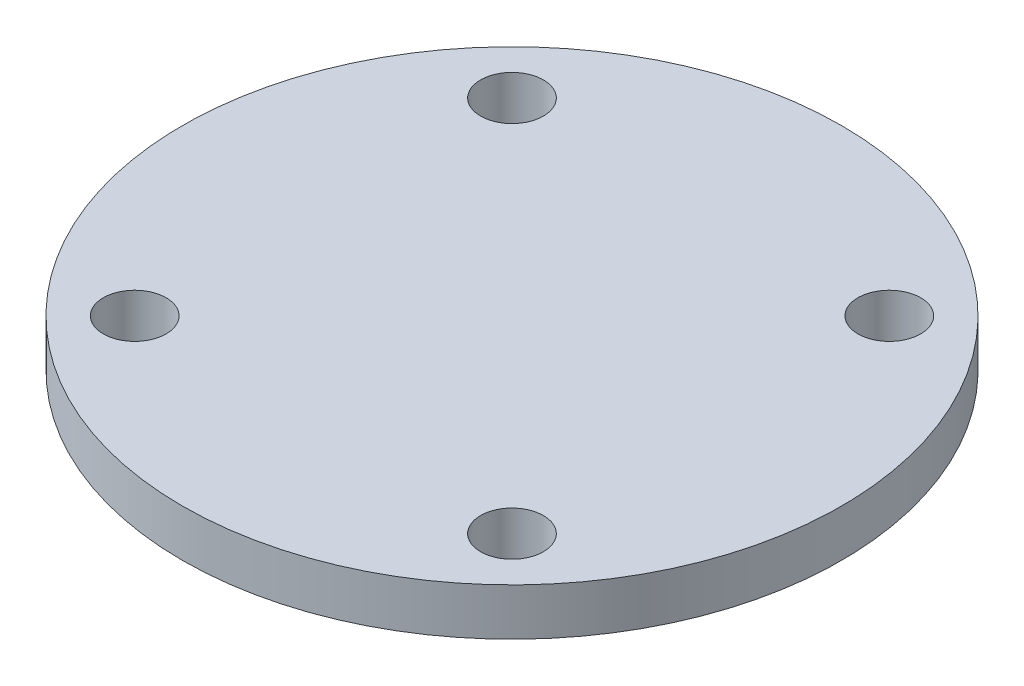
ISO-10303-21;
HEADER;
FILE_DESCRIPTION(('STEP AP214'),'2;1');
FILE_NAME('part.step','',(''),(''),'','','');
FILE_SCHEMA(('AUTOMOTIVE_DESIGN { 1 0 10303 214 1 1 1 1 }'));
ENDSEC;
DATA;
#1=APPLICATION_CONTEXT('core data for automotive mechanical design processes');
#2=APPLICATION_PROTOCOL_DEFINITION('international standard','automotive_design',2000,#1);
#3=PRODUCT_CONTEXT('',#1,'mechanical');
#4=PRODUCT('Part','Part','',(#3));
#5=PRODUCT_RELATED_PRODUCT_CATEGORY('part','',(#4));
#6=PRODUCT_DEFINITION_FORMATION('','',#4);
#7=PRODUCT_DEFINITION_CONTEXT('part definition',#1,'design');
#8=PRODUCT_DEFINITION('design','',#6,#7);
#9=PRODUCT_DEFINITION_SHAPE('','',#8);
#10=(LENGTH_UNIT() NAMED_UNIT(*) SI_UNIT(.MILLI.,.METRE.));
#11=(NAMED_UNIT(*) PLANE_ANGLE_UNIT() SI_UNIT($,.RADIAN.));
#12=(NAMED_UNIT(*) SI_UNIT($,.STERADIAN.) SOLID_ANGLE_UNIT());
#13=UNCERTAINTY_MEASURE_WITH_UNIT(LENGTH_MEASURE(1.E-05),#10,'distance_accuracy_value','');
#14=(GEOMETRIC_REPRESENTATION_CONTEXT(3) GLOBAL_UNCERTAINTY_ASSIGNED_CONTEXT((#13)) GLOBAL_UNIT_ASSIGNED_CONTEXT((#10,
#11,#12)) REPRESENTATION_CONTEXT('',''));
#15=CARTESIAN_POINT('',(0.,0.,0.));
#16=DIRECTION('',(0.,0.,1.));
#17=DIRECTION('',(1.,0.,0.));
#18=AXIS2_PLACEMENT_3D('',#15,#16,#17);
#19=CARTESIAN_POINT('',(0.,3.,0.));
#20=DIRECTION('',(0.,1.,0.));
#21=DIRECTION('',(0.,0.,1.));
#22=AXIS2_PLACEMENT_3D('',#19,#20,#21);
#23=PLANE('',#22);
#24=CARTESIAN_POINT('',(12.0208152801719,3.,12.0208152801707));
#25=DIRECTION('',(0.,1.,0.));
#26=DIRECTION('',(0.,0.,1.));
#27=AXIS2_PLACEMENT_3D('',#24,#25,#26);
#28=CIRCLE('',#27,2.00000000000094);
#29=CARTESIAN_POINT('',(12.0208152801719,3.,14.0208152801716));
#30=VERTEX_POINT('',#29);
#31=EDGE_CURVE('E60',#30,#30,#28,.T.);
#32=ORIENTED_EDGE('',*,*,#31,.F.);
#33=EDGE_LOOP('',(#32));
#34=FACE_BOUND('',#33,.T.);
#35=CARTESIAN_POINT('',(-12.0208152801712,3.,-12.0208152801714));
#36=DIRECTION('',(0.,1.,0.));
#37=DIRECTION('',(0.,0.,1.));
#38=AXIS2_PLACEMENT_3D('',#35,#36,#37);
#39=CIRCLE('',#38,2.);
#40=CARTESIAN_POINT('',(-12.0208152801712,3.,-10.0208152801714));
#41=VERTEX_POINT('',#40);
#42=EDGE_CURVE('E49',#41,#41,#39,.T.);
#43=ORIENTED_EDGE('',*,*,#42,.F.);
#44=EDGE_LOOP('',(#43));
#45=FACE_BOUND('',#44,.T.);
#46=CARTESIAN_POINT('',(0.,3.,0.));
#47=DIRECTION('',(0.,1.,0.));
#48=DIRECTION('',(0.,0.,1.));
#49=AXIS2_PLACEMENT_3D('',#46,#47,#48);
#50=CIRCLE('',#49,21.);
#51=CARTESIAN_POINT('',(0.,3.,21.));
#52=VERTEX_POINT('',#51);
#53=EDGE_CURVE('E10',#52,#52,#50,.T.);
#54=ORIENTED_EDGE('',*,*,#53,.T.);
#55=EDGE_LOOP('',(#54));
#56=FACE_BOUND('',#55,.T.);
#57=CARTESIAN_POINT('',(12.0208152801714,3.,-12.0208152801719));
#58=DIRECTION('',(0.,1.,0.));
#59=DIRECTION('',(0.,0.,1.));
#60=AXIS2_PLACEMENT_3D('',#57,#58,#59);
#61=CIRCLE('',#60,2.00000000000069);
#62=CARTESIAN_POINT('',(12.0208152801714,3.,-10.0208152801712));
#63=VERTEX_POINT('',#62);
#64=EDGE_CURVE('E54',#63,#63,#61,.T.);
#65=ORIENTED_EDGE('',*,*,#64,.F.);
#66=EDGE_LOOP('',(#65));
#67=FACE_BOUND('',#66,.T.);
#68=CARTESIAN_POINT('',(-12.0208152801707,3.,12.0208152801712));
#69=DIRECTION('',(0.,1.,0.));
#70=DIRECTION('',(0.,0.,1.));
#71=AXIS2_PLACEMENT_3D('',#68,#69,#70);
#72=CIRCLE('',#71,2.00000000000035);
#73=CARTESIAN_POINT('',(-12.0208152801707,3.,14.0208152801716));
#74=VERTEX_POINT('',#73);
#75=EDGE_CURVE('E66',#74,#74,#72,.T.);
#76=ORIENTED_EDGE('',*,*,#75,.F.);
#77=EDGE_LOOP('',(#76));
#78=FACE_BOUND('',#77,.T.);
#79=ADVANCED_FACE('F38',(#34,#45,#56,#67,#78),#23,.T.);
#80=CARTESIAN_POINT('',(0.,0.,0.));
#81=DIRECTION('',(0.,1.,0.));
#82=DIRECTION('',(0.,0.,1.));
#83=AXIS2_PLACEMENT_3D('',#80,#81,#82);
#84=PLANE('',#83);
#85=CARTESIAN_POINT('',(0.,0.,0.));
#86=DIRECTION('',(0.,1.,0.));
#87=DIRECTION('',(0.,0.,1.));
#88=AXIS2_PLACEMENT_3D('',#85,#86,#87);
#89=CIRCLE('',#88,21.);
#90=CARTESIAN_POINT('',(0.,0.,21.));
#91=VERTEX_POINT('',#90);
#92=EDGE_CURVE('E42',#91,#91,#89,.T.);
#93=ORIENTED_EDGE('',*,*,#92,.F.);
#94=EDGE_LOOP('',(#93));
#95=FACE_BOUND('',#94,.T.);
#96=CARTESIAN_POINT('',(0.,0.,0.));
#97=DIRECTION('',(0.,1.,0.));
#98=DIRECTION('',(0.,0.,1.));
#99=AXIS2_PLACEMENT_3D('',#96,#97,#98);
#100=CIRCLE('',#99,12.);
#101=CARTESIAN_POINT('',(0.,0.,12.));
#102=VERTEX_POINT('',#101);
#103=EDGE_CURVE('E72',#102,#102,#100,.F.);
#104=ORIENTED_EDGE('',*,*,#103,.F.);
#105=EDGE_LOOP('',(#104));
#106=FACE_BOUND('',#105,.T.);
#107=CARTESIAN_POINT('',(-12.0208152801712,0.,-12.0208152801714));
#108=DIRECTION('',(0.,1.,0.));
#109=DIRECTION('',(0.,0.,1.));
#110=AXIS2_PLACEMENT_3D('',#107,#108,#109);
#111=CIRCLE('',#110,2.);
#112=CARTESIAN_POINT('',(-12.0208152801712,0.,-10.0208152801714));
#113=VERTEX_POINT('',#112);
#114=EDGE_CURVE('E51',#113,#113,#111,.T.);
#115=ORIENTED_EDGE('',*,*,#114,.T.);
#116=EDGE_LOOP('',(#115));
#117=FACE_BOUND('',#116,.T.);
#118=CARTESIAN_POINT('',(12.0208152801714,0.,-12.0208152801719));
#119=DIRECTION('',(0.,1.,0.));
#120=DIRECTION('',(0.,0.,1.));
#121=AXIS2_PLACEMENT_3D('',#118,#119,#120);
#122=CIRCLE('',#121,2.00000000000069);
#123=CARTESIAN_POINT('',(12.0208152801714,0.,-10.0208152801712));
#124=VERTEX_POINT('',#123);
#125=EDGE_CURVE('E57',#124,#124,#122,.T.);
#126=ORIENTED_EDGE('',*,*,#125,.T.);
#127=EDGE_LOOP('',(#126));
#128=FACE_BOUND('',#127,.T.);
#129=CARTESIAN_POINT('',(12.0208152801719,0.,12.0208152801707));
#130=DIRECTION('',(0.,1.,0.));
#131=DIRECTION('',(0.,0.,1.));
#132=AXIS2_PLACEMENT_3D('',#129,#130,#131);
#133=CIRCLE('',#132,2.00000000000094);
#134=CARTESIAN_POINT('',(12.0208152801719,0.,14.0208152801716));
#135=VERTEX_POINT('',#134);
#136=EDGE_CURVE('E63',#135,#135,#133,.T.);
#137=ORIENTED_EDGE('',*,*,#136,.T.);
#138=EDGE_LOOP('',(#137));
#139=FACE_BOUND('',#138,.T.);
#140=CARTESIAN_POINT('',(-12.0208152801707,0.,12.0208152801712));
#141=DIRECTION('',(0.,1.,0.));
#142=DIRECTION('',(0.,0.,1.));
#143=AXIS2_PLACEMENT_3D('',#140,#141,#142);
#144=CIRCLE('',#143,2.00000000000035);
#145=CARTESIAN_POINT('',(-12.0208152801707,0.,14.0208152801716));
#146=VERTEX_POINT('',#145);
#147=EDGE_CURVE('E69',#146,#146,#144,.T.);
#148=ORIENTED_EDGE('',*,*,#147,.T.);
#149=EDGE_LOOP('',(#148));
#150=FACE_BOUND('',#149,.T.);
#151=ADVANCED_FACE('F93',(#95,#106,#117,#128,#139,#150),#84,.F.);
#152=CARTESIAN_POINT('',(0.,3.,0.));
#153=DIRECTION('',(0.,-1.,0.));
#154=DIRECTION('',(0.,0.,-1.));
#155=AXIS2_PLACEMENT_3D('',#152,#153,#154);
#156=CYLINDRICAL_SURFACE('',#155,21.);
#157=ORIENTED_EDGE('',*,*,#53,.F.);
#158=EDGE_LOOP('',(#157));
#159=FACE_BOUND('',#158,.T.);
#160=ORIENTED_EDGE('',*,*,#92,.T.);
#161=EDGE_LOOP('',(#160));
#162=FACE_BOUND('',#161,.T.);
#163=ADVANCED_FACE('F40',(#159,#162),#156,.T.);
#164=CARTESIAN_POINT('',(-12.0208152801712,3.,-12.0208152801714));
#165=DIRECTION('',(0.,-1.,0.));
#166=DIRECTION('',(0.,0.,-1.));
#167=AXIS2_PLACEMENT_3D('',#164,#165,#166);
#168=CYLINDRICAL_SURFACE('',#167,2.);
#169=ORIENTED_EDGE('',*,*,#42,.T.);
#170=EDGE_LOOP('',(#169));
#171=FACE_BOUND('',#170,.T.);
#172=ORIENTED_EDGE('',*,*,#114,.F.);
#173=EDGE_LOOP('',(#172));
#174=FACE_BOUND('',#173,.T.);
#175=ADVANCED_FACE('F103',(#171,#174),#168,.F.);
#176=CARTESIAN_POINT('',(12.0208152801714,3.,-12.0208152801719));
#177=DIRECTION('',(0.,-1.,0.));
#178=DIRECTION('',(0.,0.,-1.));
#179=AXIS2_PLACEMENT_3D('',#176,#177,#178);
#180=CYLINDRICAL_SURFACE('',#179,2.00000000000069);
#181=ORIENTED_EDGE('',*,*,#64,.T.);
#182=EDGE_LOOP('',(#181));
#183=FACE_BOUND('',#182,.T.);
#184=ORIENTED_EDGE('',*,*,#125,.F.);
#185=EDGE_LOOP('',(#184));
#186=FACE_BOUND('',#185,.T.);
#187=ADVANCED_FACE('F106',(#183,#186),#180,.F.);
#188=CARTESIAN_POINT('',(12.0208152801719,3.,12.0208152801707));
#189=DIRECTION('',(0.,-1.,0.));
#190=DIRECTION('',(0.,0.,-1.));
#191=AXIS2_PLACEMENT_3D('',#188,#189,#190);
#192=CYLINDRICAL_SURFACE('',#191,2.00000000000094);
#193=ORIENTED_EDGE('',*,*,#31,.T.);
#194=EDGE_LOOP('',(#193));
#195=FACE_BOUND('',#194,.T.);
#196=ORIENTED_EDGE('',*,*,#136,.F.);
#197=EDGE_LOOP('',(#196));
#198=FACE_BOUND('',#197,.T.);
#199=ADVANCED_FACE('F110',(#195,#198),#192,.F.);
#200=CARTESIAN_POINT('',(-12.0208152801707,3.,12.0208152801712));
#201=DIRECTION('',(0.,-1.,0.));
#202=DIRECTION('',(0.,0.,-1.));
#203=AXIS2_PLACEMENT_3D('',#200,#201,#202);
#204=CYLINDRICAL_SURFACE('',#203,2.00000000000035);
#205=ORIENTED_EDGE('',*,*,#75,.T.);
#206=EDGE_LOOP('',(#205));
#207=FACE_BOUND('',#206,.T.);
#208=ORIENTED_EDGE('',*,*,#147,.F.);
#209=EDGE_LOOP('',(#208));
#210=FACE_BOUND('',#209,.T.);
#211=ADVANCED_FACE('F90',(#207,#210),#204,.F.);
#212=CARTESIAN_POINT('',(0.,3.,0.));
#213=DIRECTION('',(0.,-1.,0.));
#214=DIRECTION('',(0.,0.,-1.));
#215=AXIS2_PLACEMENT_3D('',#212,#213,#214);
#216=CYLINDRICAL_SURFACE('',#215,12.);
#217=CARTESIAN_POINT('',(0.,-1.,0.));
#218=DIRECTION('',(0.,1.,0.));
#219=DIRECTION('',(0.,0.,1.));
#220=AXIS2_PLACEMENT_3D('',#217,#218,#219);
#221=CIRCLE('',#220,12.);
#222=CARTESIAN_POINT('',(0.,-1.,12.));
#223=VERTEX_POINT('',#222);
#224=EDGE_CURVE('E77',#223,#223,#221,.T.);
#225=ORIENTED_EDGE('',*,*,#224,.T.);
#226=EDGE_LOOP('',(#225));
#227=FACE_BOUND('',#226,.T.);
#228=ORIENTED_EDGE('',*,*,#103,.T.);
#229=EDGE_LOOP('',(#228));
#230=FACE_BOUND('',#229,.T.);
#231=ADVANCED_FACE('F81',(#227,#230),#216,.T.);
#232=CARTESIAN_POINT('',(0.,-1.,0.));
#233=DIRECTION('',(0.,1.,0.));
#234=DIRECTION('',(0.,0.,1.));
#235=AXIS2_PLACEMENT_3D('',#232,#233,#234);
#236=PLANE('',#235);
#237=ORIENTED_EDGE('',*,*,#224,.F.);
#238=EDGE_LOOP('',(#237));
#239=FACE_BOUND('',#238,.T.);
#240=ADVANCED_FACE('F84',(#239),#236,.F.);
#241=CLOSED_SHELL('',(#79,#151,#163,#175,#187,#199,#211,#231,#240));
#242=MANIFOLD_SOLID_BREP('B2',#241);
#243=ADVANCED_BREP_SHAPE_REPRESENTATION('',(#18,#242),#14);
#244=SHAPE_DEFINITION_REPRESENTATION(#9,#243);
ENDSEC;
END-ISO-10303-21;
